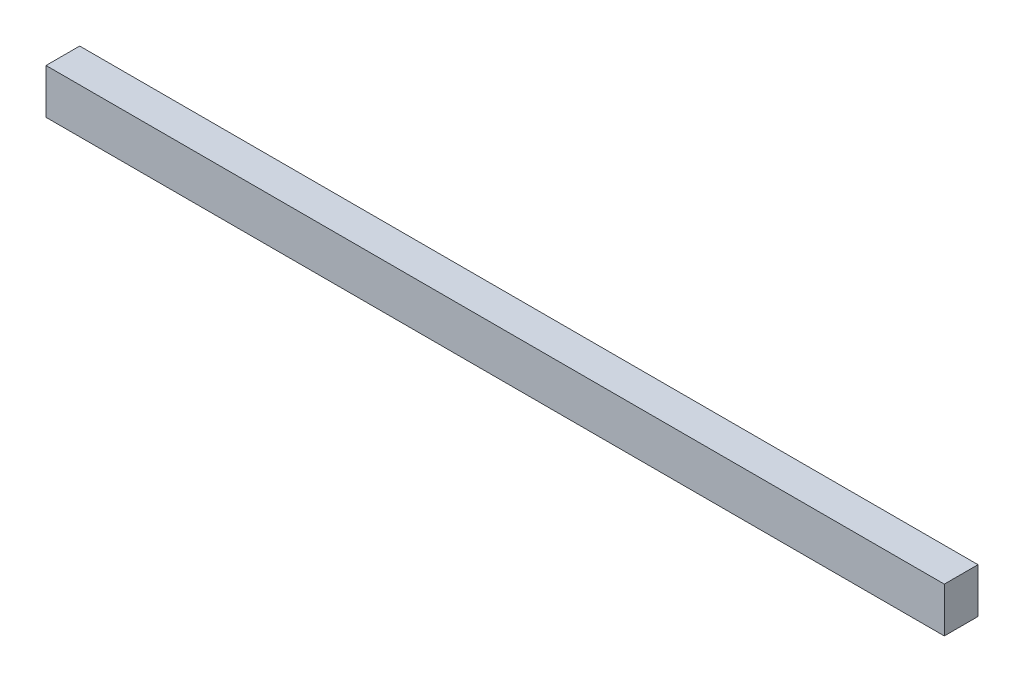
ISO-10303-21;
HEADER;
FILE_DESCRIPTION(('STEP AP214'),'2;1');
FILE_NAME('part.step','',(''),(''),'','','');
FILE_SCHEMA(('AUTOMOTIVE_DESIGN { 1 0 10303 214 1 1 1 1 }'));
ENDSEC;
DATA;
#1=APPLICATION_CONTEXT('core data for automotive mechanical design processes');
#2=APPLICATION_PROTOCOL_DEFINITION('international standard','automotive_design',2000,#1);
#3=PRODUCT_CONTEXT('',#1,'mechanical');
#4=PRODUCT('Part','Part','',(#3));
#5=PRODUCT_RELATED_PRODUCT_CATEGORY('part','',(#4));
#6=PRODUCT_DEFINITION_FORMATION('','',#4);
#7=PRODUCT_DEFINITION_CONTEXT('part definition',#1,'design');
#8=PRODUCT_DEFINITION('design','',#6,#7);
#9=PRODUCT_DEFINITION_SHAPE('','',#8);
#10=(LENGTH_UNIT() NAMED_UNIT(*) SI_UNIT(.MILLI.,.METRE.));
#11=(NAMED_UNIT(*) PLANE_ANGLE_UNIT() SI_UNIT($,.RADIAN.));
#12=(NAMED_UNIT(*) SI_UNIT($,.STERADIAN.) SOLID_ANGLE_UNIT());
#13=UNCERTAINTY_MEASURE_WITH_UNIT(LENGTH_MEASURE(1.E-05),#10,'distance_accuracy_value','');
#14=(GEOMETRIC_REPRESENTATION_CONTEXT(3) GLOBAL_UNCERTAINTY_ASSIGNED_CONTEXT((#13)) GLOBAL_UNIT_ASSIGNED_CONTEXT((#10,
#11,#12)) REPRESENTATION_CONTEXT('',''));
#15=CARTESIAN_POINT('',(0.,0.,0.));
#16=DIRECTION('',(0.,0.,1.));
#17=DIRECTION('',(1.,0.,0.));
#18=AXIS2_PLACEMENT_3D('',#15,#16,#17);
#19=CARTESIAN_POINT('',(0.,0.,-19.05));
#20=DIRECTION('',(-1.,0.,0.));
#21=DIRECTION('',(0.,0.,1.));
#22=AXIS2_PLACEMENT_3D('',#19,#20,#21);
#23=PLANE('',#22);
#24=DIRECTION('',(0.,-1.,0.));
#25=VECTOR('',#24,1.);
#26=CARTESIAN_POINT('',(0.,0.,0.));
#27=LINE('',#26,#25);
#28=CARTESIAN_POINT('',(0.,25.4,0.));
#29=VERTEX_POINT('',#28);
#30=CARTESIAN_POINT('',(0.,0.,0.));
#31=VERTEX_POINT('',#30);
#32=EDGE_CURVE('E109',#29,#31,#27,.T.);
#33=ORIENTED_EDGE('',*,*,#32,.F.);
#34=DIRECTION('',(0.,0.,1.));
#35=VECTOR('',#34,1.);
#36=CARTESIAN_POINT('',(0.,25.4,-19.05));
#37=LINE('',#36,#35);
#38=CARTESIAN_POINT('',(0.,25.4,-19.05));
#39=VERTEX_POINT('',#38);
#40=EDGE_CURVE('E11',#39,#29,#37,.T.);
#41=ORIENTED_EDGE('',*,*,#40,.F.);
#42=DIRECTION('',(0.,-1.,0.));
#43=VECTOR('',#42,1.);
#44=CARTESIAN_POINT('',(0.,0.,-19.05));
#45=LINE('',#44,#43);
#46=CARTESIAN_POINT('',(0.,0.,-19.05));
#47=VERTEX_POINT('',#46);
#48=EDGE_CURVE('E101',#39,#47,#45,.T.);
#49=ORIENTED_EDGE('',*,*,#48,.T.);
#50=DIRECTION('',(0.,0.,1.));
#51=VECTOR('',#50,1.);
#52=CARTESIAN_POINT('',(0.,0.,-19.05));
#53=LINE('',#52,#51);
#54=EDGE_CURVE('E42',#47,#31,#53,.T.);
#55=ORIENTED_EDGE('',*,*,#54,.T.);
#56=EDGE_LOOP('',(#33,#41,#49,#55));
#57=FACE_BOUND('',#56,.T.);
#58=ADVANCED_FACE('F39',(#57),#23,.T.);
#59=CARTESIAN_POINT('',(0.,25.4,-19.05));
#60=DIRECTION('',(0.,1.,0.));
#61=DIRECTION('',(0.,0.,1.));
#62=AXIS2_PLACEMENT_3D('',#59,#60,#61);
#63=PLANE('',#62);
#64=DIRECTION('',(-1.,0.,0.));
#65=VECTOR('',#64,1.);
#66=CARTESIAN_POINT('',(0.,25.4,0.));
#67=LINE('',#66,#65);
#68=CARTESIAN_POINT('',(508.,25.4,0.));
#69=VERTEX_POINT('',#68);
#70=EDGE_CURVE('E104',#69,#29,#67,.T.);
#71=ORIENTED_EDGE('',*,*,#70,.F.);
#72=DIRECTION('',(0.,0.,1.));
#73=VECTOR('',#72,1.);
#74=CARTESIAN_POINT('',(508.,25.4,-19.05));
#75=LINE('',#74,#73);
#76=CARTESIAN_POINT('',(508.,25.4,-19.05));
#77=VERTEX_POINT('',#76);
#78=EDGE_CURVE('E49',#77,#69,#75,.T.);
#79=ORIENTED_EDGE('',*,*,#78,.F.);
#80=DIRECTION('',(-1.,0.,0.));
#81=VECTOR('',#80,1.);
#82=CARTESIAN_POINT('',(0.,25.4,-19.05));
#83=LINE('',#82,#81);
#84=EDGE_CURVE('E96',#77,#39,#83,.T.);
#85=ORIENTED_EDGE('',*,*,#84,.T.);
#86=ORIENTED_EDGE('',*,*,#40,.T.);
#87=EDGE_LOOP('',(#71,#79,#85,#86));
#88=FACE_BOUND('',#87,.T.);
#89=ADVANCED_FACE('F125',(#88),#63,.T.);
#90=CARTESIAN_POINT('',(508.,0.,-19.05));
#91=DIRECTION('',(1.,0.,0.));
#92=DIRECTION('',(0.,0.,-1.));
#93=AXIS2_PLACEMENT_3D('',#90,#91,#92);
#94=PLANE('',#93);
#95=DIRECTION('',(0.,1.,0.));
#96=VECTOR('',#95,1.);
#97=CARTESIAN_POINT('',(508.,0.,0.));
#98=LINE('',#97,#96);
#99=CARTESIAN_POINT('',(508.,0.,0.));
#100=VERTEX_POINT('',#99);
#101=EDGE_CURVE('E90',#100,#69,#98,.T.);
#102=ORIENTED_EDGE('',*,*,#101,.F.);
#103=DIRECTION('',(0.,0.,1.));
#104=VECTOR('',#103,1.);
#105=CARTESIAN_POINT('',(508.,0.,-19.05));
#106=LINE('',#105,#104);
#107=CARTESIAN_POINT('',(508.,0.,-19.05));
#108=VERTEX_POINT('',#107);
#109=EDGE_CURVE('E85',#108,#100,#106,.T.);
#110=ORIENTED_EDGE('',*,*,#109,.F.);
#111=DIRECTION('',(0.,1.,0.));
#112=VECTOR('',#111,1.);
#113=CARTESIAN_POINT('',(508.,0.,-19.05));
#114=LINE('',#113,#112);
#115=EDGE_CURVE('E88',#108,#77,#114,.T.);
#116=ORIENTED_EDGE('',*,*,#115,.T.);
#117=ORIENTED_EDGE('',*,*,#78,.T.);
#118=EDGE_LOOP('',(#102,#110,#116,#117));
#119=FACE_BOUND('',#118,.T.);
#120=ADVANCED_FACE('F87',(#119),#94,.T.);
#121=CARTESIAN_POINT('',(0.,0.,-19.05));
#122=DIRECTION('',(0.,-1.,0.));
#123=DIRECTION('',(0.,0.,-1.));
#124=AXIS2_PLACEMENT_3D('',#121,#122,#123);
#125=PLANE('',#124);
#126=DIRECTION('',(1.,0.,0.));
#127=VECTOR('',#126,1.);
#128=CARTESIAN_POINT('',(0.,0.,0.));
#129=LINE('',#128,#127);
#130=EDGE_CURVE('E113',#31,#100,#129,.T.);
#131=ORIENTED_EDGE('',*,*,#130,.F.);
#132=ORIENTED_EDGE('',*,*,#54,.F.);
#133=DIRECTION('',(1.,0.,0.));
#134=VECTOR('',#133,1.);
#135=CARTESIAN_POINT('',(0.,0.,-19.05));
#136=LINE('',#135,#134);
#137=EDGE_CURVE('E95',#47,#108,#136,.T.);
#138=ORIENTED_EDGE('',*,*,#137,.T.);
#139=ORIENTED_EDGE('',*,*,#109,.T.);
#140=EDGE_LOOP('',(#131,#132,#138,#139));
#141=FACE_BOUND('',#140,.T.);
#142=ADVANCED_FACE('F99',(#141),#125,.T.);
#143=CARTESIAN_POINT('',(0.,0.,-19.05));
#144=DIRECTION('',(0.,0.,-1.));
#145=DIRECTION('',(-1.,0.,0.));
#146=AXIS2_PLACEMENT_3D('',#143,#144,#145);
#147=PLANE('',#146);
#148=ORIENTED_EDGE('',*,*,#48,.F.);
#149=ORIENTED_EDGE('',*,*,#84,.F.);
#150=ORIENTED_EDGE('',*,*,#115,.F.);
#151=ORIENTED_EDGE('',*,*,#137,.F.);
#152=EDGE_LOOP('',(#148,#149,#150,#151));
#153=FACE_BOUND('',#152,.T.);
#154=ADVANCED_FACE('F94',(#153),#147,.T.);
#155=CARTESIAN_POINT('',(0.,0.,0.));
#156=DIRECTION('',(0.,0.,-1.));
#157=DIRECTION('',(-1.,0.,0.));
#158=AXIS2_PLACEMENT_3D('',#155,#156,#157);
#159=PLANE('',#158);
#160=ORIENTED_EDGE('',*,*,#32,.T.);
#161=ORIENTED_EDGE('',*,*,#130,.T.);
#162=ORIENTED_EDGE('',*,*,#101,.T.);
#163=ORIENTED_EDGE('',*,*,#70,.T.);
#164=EDGE_LOOP('',(#160,#161,#162,#163));
#165=FACE_BOUND('',#164,.T.);
#166=ADVANCED_FACE('F124',(#165),#159,.F.);
#167=CLOSED_SHELL('',(#58,#89,#120,#142,#154,#166));
#168=MANIFOLD_SOLID_BREP('B2',#167);
#169=ADVANCED_BREP_SHAPE_REPRESENTATION('',(#18,#168),#14);
#170=SHAPE_DEFINITION_REPRESENTATION(#9,#169);
ENDSEC;
END-ISO-10303-21;
